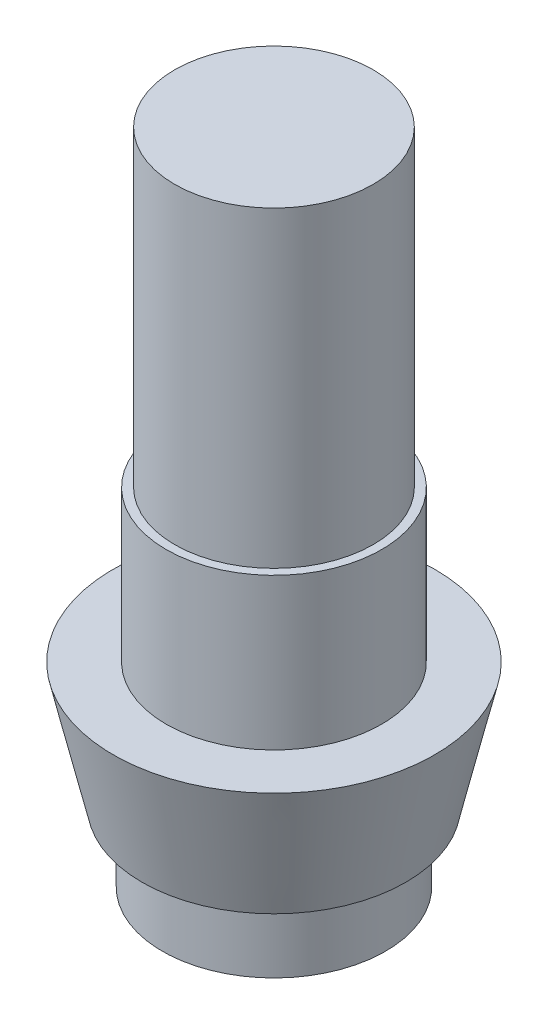
ISO-10303-21;
HEADER;
FILE_DESCRIPTION(('STEP AP214'),'2;1');
FILE_NAME('part.step','',(''),(''),'','','');
FILE_SCHEMA(('AUTOMOTIVE_DESIGN { 1 0 10303 214 1 1 1 1 }'));
ENDSEC;
DATA;
#1=APPLICATION_CONTEXT('core data for automotive mechanical design processes');
#2=APPLICATION_PROTOCOL_DEFINITION('international standard','automotive_design',2000,#1);
#3=PRODUCT_CONTEXT('',#1,'mechanical');
#4=PRODUCT('Part','Part','',(#3));
#5=PRODUCT_RELATED_PRODUCT_CATEGORY('part','',(#4));
#6=PRODUCT_DEFINITION_FORMATION('','',#4);
#7=PRODUCT_DEFINITION_CONTEXT('part definition',#1,'design');
#8=PRODUCT_DEFINITION('design','',#6,#7);
#9=PRODUCT_DEFINITION_SHAPE('','',#8);
#10=(LENGTH_UNIT() NAMED_UNIT(*) SI_UNIT(.MILLI.,.METRE.));
#11=(NAMED_UNIT(*) PLANE_ANGLE_UNIT() SI_UNIT($,.RADIAN.));
#12=(NAMED_UNIT(*) SI_UNIT($,.STERADIAN.) SOLID_ANGLE_UNIT());
#13=UNCERTAINTY_MEASURE_WITH_UNIT(LENGTH_MEASURE(1.E-05),#10,'distance_accuracy_value','');
#14=(GEOMETRIC_REPRESENTATION_CONTEXT(3) GLOBAL_UNCERTAINTY_ASSIGNED_CONTEXT((#13)) GLOBAL_UNIT_ASSIGNED_CONTEXT((#10,
#11,#12)) REPRESENTATION_CONTEXT('',''));
#15=CARTESIAN_POINT('',(0.,0.,0.));
#16=DIRECTION('',(0.,0.,1.));
#17=DIRECTION('',(1.,0.,0.));
#18=AXIS2_PLACEMENT_3D('',#15,#16,#17);
#19=CARTESIAN_POINT('',(0.,8.,0.));
#20=DIRECTION('',(0.,-1.,0.));
#21=DIRECTION('',(0.,0.,-1.));
#22=AXIS2_PLACEMENT_3D('',#19,#20,#21);
#23=CYLINDRICAL_SURFACE('',#22,5.7);
#24=CARTESIAN_POINT('',(0.,8.,0.));
#25=DIRECTION('',(0.,1.,0.));
#26=DIRECTION('',(0.,0.,1.));
#27=AXIS2_PLACEMENT_3D('',#24,#25,#26);
#28=CIRCLE('',#27,5.7);
#29=CARTESIAN_POINT('',(0.,8.,5.7));
#30=VERTEX_POINT('',#29);
#31=EDGE_CURVE('E10',#30,#30,#28,.T.);
#32=ORIENTED_EDGE('',*,*,#31,.F.);
#33=EDGE_LOOP('',(#32));
#34=FACE_BOUND('',#33,.T.);
#35=CARTESIAN_POINT('',(0.,0.,0.));
#36=DIRECTION('',(0.,-1.,0.));
#37=DIRECTION('',(0.,0.,-1.));
#38=AXIS2_PLACEMENT_3D('',#35,#36,#37);
#39=CIRCLE('',#38,5.7);
#40=CARTESIAN_POINT('',(0.,0.,-5.7));
#41=VERTEX_POINT('',#40);
#42=EDGE_CURVE('E52',#41,#41,#39,.T.);
#43=ORIENTED_EDGE('',*,*,#42,.F.);
#44=EDGE_LOOP('',(#43));
#45=FACE_BOUND('',#44,.T.);
#46=ADVANCED_FACE('F37',(#34,#45),#23,.T.);
#47=CARTESIAN_POINT('',(0.,8.,0.));
#48=DIRECTION('',(0.,1.,0.));
#49=DIRECTION('',(0.,0.,1.));
#50=AXIS2_PLACEMENT_3D('',#47,#48,#49);
#51=PLANE('',#50);
#52=CARTESIAN_POINT('',(0.,8.,0.));
#53=DIRECTION('',(0.,1.,0.));
#54=DIRECTION('',(0.,0.,1.));
#55=AXIS2_PLACEMENT_3D('',#52,#53,#54);
#56=CIRCLE('',#55,5.25);
#57=CARTESIAN_POINT('',(0.,8.,5.25));
#58=VERTEX_POINT('',#57);
#59=EDGE_CURVE('E47',#58,#58,#56,.T.);
#60=ORIENTED_EDGE('',*,*,#59,.F.);
#61=EDGE_LOOP('',(#60));
#62=FACE_BOUND('',#61,.T.);
#63=ORIENTED_EDGE('',*,*,#31,.T.);
#64=EDGE_LOOP('',(#63));
#65=FACE_BOUND('',#64,.T.);
#66=ADVANCED_FACE('F97',(#62,#65),#51,.T.);
#67=CARTESIAN_POINT('',(0.,24.5,0.));
#68=DIRECTION('',(0.,-1.,0.));
#69=DIRECTION('',(0.,0.,-1.));
#70=AXIS2_PLACEMENT_3D('',#67,#68,#69);
#71=CYLINDRICAL_SURFACE('',#70,5.25);
#72=CARTESIAN_POINT('',(0.,24.5,0.));
#73=DIRECTION('',(0.,1.,0.));
#74=DIRECTION('',(0.,0.,1.));
#75=AXIS2_PLACEMENT_3D('',#72,#73,#74);
#76=CIRCLE('',#75,5.25);
#77=CARTESIAN_POINT('',(0.,24.5,5.25));
#78=VERTEX_POINT('',#77);
#79=EDGE_CURVE('E43',#78,#78,#76,.T.);
#80=ORIENTED_EDGE('',*,*,#79,.F.);
#81=EDGE_LOOP('',(#80));
#82=FACE_BOUND('',#81,.T.);
#83=ORIENTED_EDGE('',*,*,#59,.T.);
#84=EDGE_LOOP('',(#83));
#85=FACE_BOUND('',#84,.T.);
#86=ADVANCED_FACE('F102',(#82,#85),#71,.T.);
#87=CARTESIAN_POINT('',(0.,24.5,0.));
#88=DIRECTION('',(0.,1.,0.));
#89=DIRECTION('',(0.,0.,1.));
#90=AXIS2_PLACEMENT_3D('',#87,#88,#89);
#91=PLANE('',#90);
#92=ORIENTED_EDGE('',*,*,#79,.T.);
#93=EDGE_LOOP('',(#92));
#94=FACE_BOUND('',#93,.T.);
#95=ADVANCED_FACE('F87',(#94),#91,.T.);
#96=CARTESIAN_POINT('',(0.,0.,0.));
#97=DIRECTION('',(0.,1.,0.));
#98=DIRECTION('',(0.,0.,-1.));
#99=AXIS2_PLACEMENT_3D('',#96,#97,#98);
#100=CONICAL_SURFACE('',#99,8.5,0.226892802759263);
#101=CARTESIAN_POINT('',(0.,-6.6,0.));
#102=DIRECTION('',(0.,-1.,0.));
#103=DIRECTION('',(0.,0.,-1.));
#104=AXIS2_PLACEMENT_3D('',#101,#102,#103);
#105=CIRCLE('',#104,6.97626993857128);
#106=CARTESIAN_POINT('',(0.,-6.6,-6.97626993857128));
#107=VERTEX_POINT('',#106);
#108=EDGE_CURVE('E56',#107,#107,#105,.T.);
#109=ORIENTED_EDGE('',*,*,#108,.F.);
#110=EDGE_LOOP('',(#109));
#111=FACE_BOUND('',#110,.T.);
#112=CARTESIAN_POINT('',(0.,0.,0.));
#113=DIRECTION('',(0.,-1.,0.));
#114=DIRECTION('',(0.,0.,-1.));
#115=AXIS2_PLACEMENT_3D('',#112,#113,#114);
#116=CIRCLE('',#115,8.5);
#117=CARTESIAN_POINT('',(0.,0.,-8.5));
#118=VERTEX_POINT('',#117);
#119=EDGE_CURVE('E59',#118,#118,#116,.T.);
#120=ORIENTED_EDGE('',*,*,#119,.T.);
#121=EDGE_LOOP('',(#120));
#122=FACE_BOUND('',#121,.T.);
#123=ADVANCED_FACE('F81',(#111,#122),#100,.T.);
#124=CARTESIAN_POINT('',(0.,-6.6,0.));
#125=DIRECTION('',(0.,-1.,0.));
#126=DIRECTION('',(0.,0.,-1.));
#127=AXIS2_PLACEMENT_3D('',#124,#125,#126);
#128=PLANE('',#127);
#129=CARTESIAN_POINT('',(0.,-6.6,0.));
#130=DIRECTION('',(0.,-1.,0.));
#131=DIRECTION('',(0.,0.,-1.));
#132=AXIS2_PLACEMENT_3D('',#129,#130,#131);
#133=CIRCLE('',#132,5.9);
#134=CARTESIAN_POINT('',(0.,-6.6,-5.9));
#135=VERTEX_POINT('',#134);
#136=EDGE_CURVE('E63',#135,#135,#133,.T.);
#137=ORIENTED_EDGE('',*,*,#136,.F.);
#138=EDGE_LOOP('',(#137));
#139=FACE_BOUND('',#138,.T.);
#140=ORIENTED_EDGE('',*,*,#108,.T.);
#141=EDGE_LOOP('',(#140));
#142=FACE_BOUND('',#141,.T.);
#143=ADVANCED_FACE('F78',(#139,#142),#128,.T.);
#144=CARTESIAN_POINT('',(0.,0.,0.));
#145=DIRECTION('',(0.,-1.,0.));
#146=DIRECTION('',(0.,0.,-1.));
#147=AXIS2_PLACEMENT_3D('',#144,#145,#146);
#148=PLANE('',#147);
#149=ORIENTED_EDGE('',*,*,#42,.T.);
#150=EDGE_LOOP('',(#149));
#151=FACE_BOUND('',#150,.T.);
#152=ORIENTED_EDGE('',*,*,#119,.F.);
#153=EDGE_LOOP('',(#152));
#154=FACE_BOUND('',#153,.T.);
#155=ADVANCED_FACE('F74',(#151,#154),#148,.F.);
#156=CARTESIAN_POINT('',(0.,-10.3,0.));
#157=DIRECTION('',(0.,1.,0.));
#158=DIRECTION('',(0.,0.,1.));
#159=AXIS2_PLACEMENT_3D('',#156,#157,#158);
#160=CYLINDRICAL_SURFACE('',#159,5.9);
#161=CARTESIAN_POINT('',(0.,-10.3,0.));
#162=DIRECTION('',(0.,-1.,0.));
#163=DIRECTION('',(0.,0.,-1.));
#164=AXIS2_PLACEMENT_3D('',#161,#162,#163);
#165=CIRCLE('',#164,5.9);
#166=CARTESIAN_POINT('',(0.,-10.3,-5.9));
#167=VERTEX_POINT('',#166);
#168=EDGE_CURVE('E62',#167,#167,#165,.T.);
#169=ORIENTED_EDGE('',*,*,#168,.F.);
#170=EDGE_LOOP('',(#169));
#171=FACE_BOUND('',#170,.T.);
#172=ORIENTED_EDGE('',*,*,#136,.T.);
#173=EDGE_LOOP('',(#172));
#174=FACE_BOUND('',#173,.T.);
#175=ADVANCED_FACE('F71',(#171,#174),#160,.T.);
#176=CARTESIAN_POINT('',(0.,-10.3,0.));
#177=DIRECTION('',(0.,-1.,0.));
#178=DIRECTION('',(0.,0.,-1.));
#179=AXIS2_PLACEMENT_3D('',#176,#177,#178);
#180=PLANE('',#179);
#181=ORIENTED_EDGE('',*,*,#168,.T.);
#182=EDGE_LOOP('',(#181));
#183=FACE_BOUND('',#182,.T.);
#184=ADVANCED_FACE('F69',(#183),#180,.T.);
#185=CLOSED_SHELL('',(#46,#66,#86,#95,#123,#143,#155,#175,#184));
#186=MANIFOLD_SOLID_BREP('B2',#185);
#187=ADVANCED_BREP_SHAPE_REPRESENTATION('',(#18,#186),#14);
#188=SHAPE_DEFINITION_REPRESENTATION(#9,#187);
ENDSEC;
END-ISO-10303-21;
